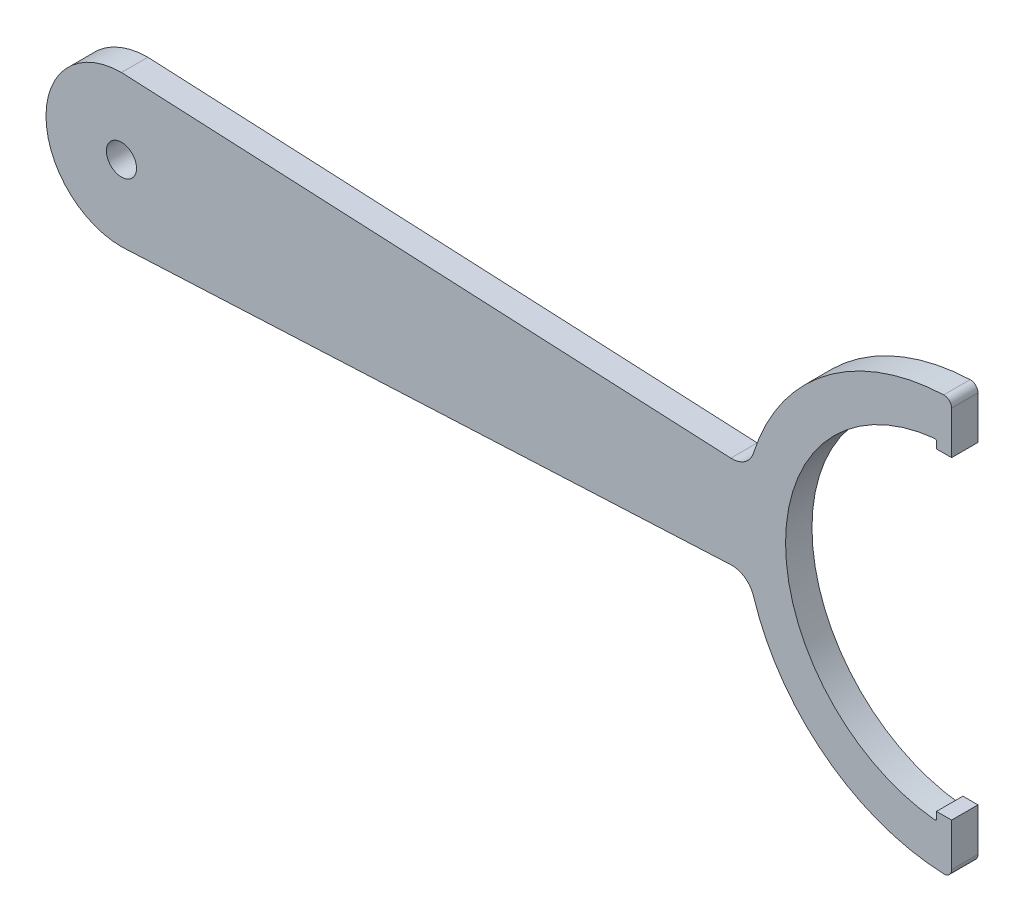
ISO-10303-21;
HEADER;
FILE_DESCRIPTION(('STEP AP214'),'2;1');
FILE_NAME('part.step','',(''),(''),'','','');
FILE_SCHEMA(('AUTOMOTIVE_DESIGN { 1 0 10303 214 1 1 1 1 }'));
ENDSEC;
DATA;
#1=APPLICATION_CONTEXT('core data for automotive mechanical design processes');
#2=APPLICATION_PROTOCOL_DEFINITION('international standard','automotive_design',2000,#1);
#3=PRODUCT_CONTEXT('',#1,'mechanical');
#4=PRODUCT('Part','Part','',(#3));
#5=PRODUCT_RELATED_PRODUCT_CATEGORY('part','',(#4));
#6=PRODUCT_DEFINITION_FORMATION('','',#4);
#7=PRODUCT_DEFINITION_CONTEXT('part definition',#1,'design');
#8=PRODUCT_DEFINITION('design','',#6,#7);
#9=PRODUCT_DEFINITION_SHAPE('','',#8);
#10=(LENGTH_UNIT() NAMED_UNIT(*) SI_UNIT(.MILLI.,.METRE.));
#11=(NAMED_UNIT(*) PLANE_ANGLE_UNIT() SI_UNIT($,.RADIAN.));
#12=(NAMED_UNIT(*) SI_UNIT($,.STERADIAN.) SOLID_ANGLE_UNIT());
#13=UNCERTAINTY_MEASURE_WITH_UNIT(LENGTH_MEASURE(1.E-05),#10,'distance_accuracy_value','');
#14=(GEOMETRIC_REPRESENTATION_CONTEXT(3) GLOBAL_UNCERTAINTY_ASSIGNED_CONTEXT((#13)) GLOBAL_UNIT_ASSIGNED_CONTEXT((#10,
#11,#12)) REPRESENTATION_CONTEXT('',''));
#15=CARTESIAN_POINT('',(0.,0.,0.));
#16=DIRECTION('',(0.,0.,1.));
#17=DIRECTION('',(1.,0.,0.));
#18=AXIS2_PLACEMENT_3D('',#15,#16,#17);
#19=CARTESIAN_POINT('',(0.,0.,3.5));
#20=DIRECTION('',(0.,0.,-1.));
#21=DIRECTION('',(-1.,0.,0.));
#22=AXIS2_PLACEMENT_3D('',#19,#20,#21);
#23=CYLINDRICAL_SURFACE('',#22,10.);
#24=CARTESIAN_POINT('',(0.,0.,0.));
#25=DIRECTION('',(0.,0.,1.));
#26=DIRECTION('',(1.,0.,0.));
#27=AXIS2_PLACEMENT_3D('',#24,#25,#26);
#28=CIRCLE('',#27,10.);
#29=CARTESIAN_POINT('',(0.,10.,0.));
#30=VERTEX_POINT('',#29);
#31=CARTESIAN_POINT('',(0.,-10.,0.));
#32=VERTEX_POINT('',#31);
#33=EDGE_CURVE('E181',#30,#32,#28,.T.);
#34=ORIENTED_EDGE('',*,*,#33,.T.);
#35=DIRECTION('',(0.,0.,-1.));
#36=VECTOR('',#35,1.);
#37=CARTESIAN_POINT('',(0.,-10.,3.5));
#38=LINE('',#37,#36);
#39=CARTESIAN_POINT('',(0.,-10.,3.5));
#40=VERTEX_POINT('',#39);
#41=EDGE_CURVE('E161',#40,#32,#38,.T.);
#42=ORIENTED_EDGE('',*,*,#41,.F.);
#43=CARTESIAN_POINT('',(0.,0.,3.5));
#44=DIRECTION('',(0.,0.,1.));
#45=DIRECTION('',(1.,0.,0.));
#46=AXIS2_PLACEMENT_3D('',#43,#44,#45);
#47=CIRCLE('',#46,10.);
#48=CARTESIAN_POINT('',(0.,10.,3.5));
#49=VERTEX_POINT('',#48);
#50=EDGE_CURVE('E168',#49,#40,#47,.T.);
#51=ORIENTED_EDGE('',*,*,#50,.F.);
#52=DIRECTION('',(0.,0.,-1.));
#53=VECTOR('',#52,1.);
#54=CARTESIAN_POINT('',(0.,10.,3.5));
#55=LINE('',#54,#53);
#56=EDGE_CURVE('E266',#49,#30,#55,.T.);
#57=ORIENTED_EDGE('',*,*,#56,.T.);
#58=EDGE_LOOP('',(#34,#42,#51,#57));
#59=FACE_BOUND('',#58,.T.);
#60=ADVANCED_FACE('F31',(#59),#23,.T.);
#61=CARTESIAN_POINT('',(0.,-10.,3.5));
#62=DIRECTION('',(-0.0480430459156585,0.998845266164458,0.));
#63=DIRECTION('',(-0.998845266164458,-0.0480430459156585,0.));
#64=AXIS2_PLACEMENT_3D('',#61,#62,#63);
#65=PLANE('',#64);
#66=DIRECTION('',(0.998845266164458,0.0480430459156585,0.));
#67=VECTOR('',#66,1.);
#68=CARTESIAN_POINT('',(0.,-10.,0.));
#69=LINE('',#68,#67);
#70=CARTESIAN_POINT('',(80.7489971112287,-6.11608733877766,0.));
#71=VERTEX_POINT('',#70);
#72=EDGE_CURVE('E293',#32,#71,#69,.T.);
#73=ORIENTED_EDGE('',*,*,#72,.T.);
#74=DIRECTION('',(0.,0.,1.));
#75=VECTOR('',#74,1.);
#76=CARTESIAN_POINT('',(80.7489971112286,-6.11608733877766,3.5));
#77=LINE('',#76,#75);
#78=CARTESIAN_POINT('',(80.7489971112287,-6.11608733877766,3.5));
#79=VERTEX_POINT('',#78);
#80=EDGE_CURVE('E164',#71,#79,#77,.T.);
#81=ORIENTED_EDGE('',*,*,#80,.T.);
#82=DIRECTION('',(0.998845266164458,0.0480430459156585,0.));
#83=VECTOR('',#82,1.);
#84=CARTESIAN_POINT('',(0.,-10.,3.5));
#85=LINE('',#84,#83);
#86=EDGE_CURVE('E156',#40,#79,#85,.T.);
#87=ORIENTED_EDGE('',*,*,#86,.F.);
#88=ORIENTED_EDGE('',*,*,#41,.T.);
#89=EDGE_LOOP('',(#73,#81,#87,#88));
#90=FACE_BOUND('',#89,.T.);
#91=ADVANCED_FACE('F159',(#90),#65,.F.);
#92=CARTESIAN_POINT('',(110.,0.,3.5));
#93=DIRECTION('',(0.,0.,-1.));
#94=DIRECTION('',(-1.,0.,0.));
#95=AXIS2_PLACEMENT_3D('',#92,#93,#94);
#96=CYLINDRICAL_SURFACE('',#95,27.5);
#97=CARTESIAN_POINT('',(110.,0.,0.));
#98=DIRECTION('',(0.,0.,1.));
#99=DIRECTION('',(1.,0.,0.));
#100=AXIS2_PLACEMENT_3D('',#97,#98,#99);
#101=CIRCLE('',#100,27.5);
#102=CARTESIAN_POINT('',(83.756097437601,-8.21629954999847,0.));
#103=VERTEX_POINT('',#102);
#104=CARTESIAN_POINT('',(108.962264150944,-27.4804131029281,0.));
#105=VERTEX_POINT('',#104);
#106=EDGE_CURVE('E290',#103,#105,#101,.T.);
#107=ORIENTED_EDGE('',*,*,#106,.T.);
#108=DIRECTION('',(0.,0.,-1.));
#109=VECTOR('',#108,1.);
#110=CARTESIAN_POINT('',(108.962264150944,-27.4804131029281,3.5));
#111=LINE('',#110,#109);
#112=CARTESIAN_POINT('',(108.962264150944,-27.4804131029281,3.5));
#113=VERTEX_POINT('',#112);
#114=EDGE_CURVE('E222',#105,#113,#111,.F.);
#115=ORIENTED_EDGE('',*,*,#114,.T.);
#116=CARTESIAN_POINT('',(110.,0.,3.5));
#117=DIRECTION('',(0.,0.,1.));
#118=DIRECTION('',(1.,0.,0.));
#119=AXIS2_PLACEMENT_3D('',#116,#117,#118);
#120=CIRCLE('',#119,27.5);
#121=CARTESIAN_POINT('',(83.756097437601,-8.21629954999847,3.5));
#122=VERTEX_POINT('',#121);
#123=EDGE_CURVE('E167',#122,#113,#120,.T.);
#124=ORIENTED_EDGE('',*,*,#123,.F.);
#125=DIRECTION('',(0.,0.,-1.));
#126=VECTOR('',#125,1.);
#127=CARTESIAN_POINT('',(83.756097437601,-8.21629954999847,3.5));
#128=LINE('',#127,#126);
#129=EDGE_CURVE('E200',#122,#103,#128,.T.);
#130=ORIENTED_EDGE('',*,*,#129,.T.);
#131=EDGE_LOOP('',(#107,#115,#124,#130));
#132=FACE_BOUND('',#131,.T.);
#133=ADVANCED_FACE('F344',(#132),#96,.T.);
#134=CARTESIAN_POINT('',(110.,-20.7944947177034,3.5));
#135=DIRECTION('',(-1.,0.,0.));
#136=DIRECTION('',(0.,-1.,0.));
#137=AXIS2_PLACEMENT_3D('',#134,#135,#136);
#138=PLANE('',#137);
#139=DIRECTION('',(0.,1.,0.));
#140=VECTOR('',#139,1.);
#141=CARTESIAN_POINT('',(110.,-20.7944947177034,3.5));
#142=LINE('',#141,#140);
#143=CARTESIAN_POINT('',(110.,-26.4811253537307,3.5));
#144=VERTEX_POINT('',#143);
#145=CARTESIAN_POINT('',(110.,-20.7944947177034,3.5));
#146=VERTEX_POINT('',#145);
#147=EDGE_CURVE('E311',#144,#146,#142,.T.);
#148=ORIENTED_EDGE('',*,*,#147,.F.);
#149=DIRECTION('',(0.,0.,-1.));
#150=VECTOR('',#149,1.);
#151=CARTESIAN_POINT('',(110.,-26.4811253537307,3.5));
#152=LINE('',#151,#150);
#153=CARTESIAN_POINT('',(110.,-26.4811253537307,0.));
#154=VERTEX_POINT('',#153);
#155=EDGE_CURVE('E217',#144,#154,#152,.T.);
#156=ORIENTED_EDGE('',*,*,#155,.T.);
#157=DIRECTION('',(0.,1.,0.));
#158=VECTOR('',#157,1.);
#159=CARTESIAN_POINT('',(110.,-20.7944947177034,0.));
#160=LINE('',#159,#158);
#161=CARTESIAN_POINT('',(110.,-20.7944947177034,0.));
#162=VERTEX_POINT('',#161);
#163=EDGE_CURVE('E286',#154,#162,#160,.T.);
#164=ORIENTED_EDGE('',*,*,#163,.T.);
#165=DIRECTION('',(0.,0.,-1.));
#166=VECTOR('',#165,1.);
#167=CARTESIAN_POINT('',(110.,-20.7944947177034,3.5));
#168=LINE('',#167,#166);
#169=EDGE_CURVE('E183',#146,#162,#168,.T.);
#170=ORIENTED_EDGE('',*,*,#169,.F.);
#171=EDGE_LOOP('',(#148,#156,#164,#170));
#172=FACE_BOUND('',#171,.T.);
#173=ADVANCED_FACE('F398',(#172),#138,.F.);
#174=CARTESIAN_POINT('',(110.,-20.7944947177034,3.5));
#175=DIRECTION('',(0.,-1.,0.));
#176=DIRECTION('',(0.,0.,-1.));
#177=AXIS2_PLACEMENT_3D('',#174,#175,#176);
#178=PLANE('',#177);
#179=DIRECTION('',(-1.,0.,0.));
#180=VECTOR('',#179,1.);
#181=CARTESIAN_POINT('',(110.,-20.7944947177034,0.));
#182=LINE('',#181,#180);
#183=CARTESIAN_POINT('',(108.,-20.7944947177034,0.));
#184=VERTEX_POINT('',#183);
#185=EDGE_CURVE('E285',#162,#184,#182,.T.);
#186=ORIENTED_EDGE('',*,*,#185,.T.);
#187=DIRECTION('',(0.,0.,-1.));
#188=VECTOR('',#187,1.);
#189=CARTESIAN_POINT('',(108.,-20.7944947177034,3.5));
#190=LINE('',#189,#188);
#191=CARTESIAN_POINT('',(108.,-20.7944947177034,3.5));
#192=VERTEX_POINT('',#191);
#193=EDGE_CURVE('E189',#192,#184,#190,.T.);
#194=ORIENTED_EDGE('',*,*,#193,.F.);
#195=DIRECTION('',(-1.,0.,0.));
#196=VECTOR('',#195,1.);
#197=CARTESIAN_POINT('',(110.,-20.7944947177034,3.5));
#198=LINE('',#197,#196);
#199=EDGE_CURVE('E309',#146,#192,#198,.T.);
#200=ORIENTED_EDGE('',*,*,#199,.F.);
#201=ORIENTED_EDGE('',*,*,#169,.T.);
#202=EDGE_LOOP('',(#186,#194,#200,#201));
#203=FACE_BOUND('',#202,.T.);
#204=ADVANCED_FACE('F399',(#203),#178,.F.);
#205=CARTESIAN_POINT('',(108.,-20.7944947177034,3.5));
#206=DIRECTION('',(1.,0.,0.));
#207=DIRECTION('',(0.,1.,0.));
#208=AXIS2_PLACEMENT_3D('',#205,#206,#207);
#209=PLANE('',#208);
#210=DIRECTION('',(0.,-1.,0.));
#211=VECTOR('',#210,1.);
#212=CARTESIAN_POINT('',(108.,-20.7944947177034,0.));
#213=LINE('',#212,#211);
#214=CARTESIAN_POINT('',(108.,-21.6887067387615,0.));
#215=VERTEX_POINT('',#214);
#216=EDGE_CURVE('E257',#184,#215,#213,.T.);
#217=ORIENTED_EDGE('',*,*,#216,.T.);
#218=DIRECTION('',(0.,0.,1.));
#219=VECTOR('',#218,1.);
#220=CARTESIAN_POINT('',(108.,-21.6887067387615,3.5));
#221=LINE('',#220,#219);
#222=CARTESIAN_POINT('',(108.,-21.6887067387615,3.5));
#223=VERTEX_POINT('',#222);
#224=EDGE_CURVE('E229',#215,#223,#221,.T.);
#225=ORIENTED_EDGE('',*,*,#224,.T.);
#226=DIRECTION('',(0.,-1.,0.));
#227=VECTOR('',#226,1.);
#228=CARTESIAN_POINT('',(108.,-20.7944947177034,3.5));
#229=LINE('',#228,#227);
#230=EDGE_CURVE('E281',#192,#223,#229,.T.);
#231=ORIENTED_EDGE('',*,*,#230,.F.);
#232=ORIENTED_EDGE('',*,*,#193,.T.);
#233=EDGE_LOOP('',(#217,#225,#231,#232));
#234=FACE_BOUND('',#233,.T.);
#235=ADVANCED_FACE('F278',(#234),#209,.F.);
#236=CARTESIAN_POINT('',(110.,0.,3.5));
#237=DIRECTION('',(0.,0.,-1.));
#238=DIRECTION('',(-1.,0.,0.));
#239=AXIS2_PLACEMENT_3D('',#236,#237,#238);
#240=CYLINDRICAL_SURFACE('',#239,22.);
#241=CARTESIAN_POINT('',(110.,0.,0.));
#242=DIRECTION('',(0.,0.,-1.));
#243=DIRECTION('',(1.,0.,0.));
#244=AXIS2_PLACEMENT_3D('',#241,#242,#243);
#245=CIRCLE('',#244,22.);
#246=CARTESIAN_POINT('',(107.779816513761,-21.8876856996676,0.));
#247=VERTEX_POINT('',#246);
#248=CARTESIAN_POINT('',(107.779816513761,21.8876856996676,0.));
#249=VERTEX_POINT('',#248);
#250=EDGE_CURVE('E253',#247,#249,#245,.T.);
#251=ORIENTED_EDGE('',*,*,#250,.T.);
#252=DIRECTION('',(0.,0.,-1.));
#253=VECTOR('',#252,1.);
#254=CARTESIAN_POINT('',(107.779816513761,21.8876856996676,3.5));
#255=LINE('',#254,#253);
#256=CARTESIAN_POINT('',(107.779816513761,21.8876856996676,3.5));
#257=VERTEX_POINT('',#256);
#258=EDGE_CURVE('E52',#249,#257,#255,.F.);
#259=ORIENTED_EDGE('',*,*,#258,.T.);
#260=CARTESIAN_POINT('',(110.,0.,3.5));
#261=DIRECTION('',(0.,0.,-1.));
#262=DIRECTION('',(1.,0.,0.));
#263=AXIS2_PLACEMENT_3D('',#260,#261,#262);
#264=CIRCLE('',#263,22.);
#265=CARTESIAN_POINT('',(107.779816513761,-21.8876856996676,3.5));
#266=VERTEX_POINT('',#265);
#267=EDGE_CURVE('E306',#266,#257,#264,.T.);
#268=ORIENTED_EDGE('',*,*,#267,.F.);
#269=DIRECTION('',(0.,0.,-1.));
#270=VECTOR('',#269,1.);
#271=CARTESIAN_POINT('',(107.779816513761,-21.8876856996676,3.5));
#272=LINE('',#271,#270);
#273=EDGE_CURVE('E226',#266,#247,#272,.T.);
#274=ORIENTED_EDGE('',*,*,#273,.T.);
#275=EDGE_LOOP('',(#251,#259,#268,#274));
#276=FACE_BOUND('',#275,.T.);
#277=ADVANCED_FACE('F370',(#276),#240,.F.);
#278=CARTESIAN_POINT('',(108.,20.7944947177034,3.5));
#279=DIRECTION('',(1.,0.,0.));
#280=DIRECTION('',(0.,0.,-1.));
#281=AXIS2_PLACEMENT_3D('',#278,#279,#280);
#282=PLANE('',#281);
#283=DIRECTION('',(0.,-1.,0.));
#284=VECTOR('',#283,1.);
#285=CARTESIAN_POINT('',(108.,20.7944947177034,3.5));
#286=LINE('',#285,#284);
#287=CARTESIAN_POINT('',(108.,21.6887067387615,3.5));
#288=VERTEX_POINT('',#287);
#289=CARTESIAN_POINT('',(108.,20.7944947177034,3.5));
#290=VERTEX_POINT('',#289);
#291=EDGE_CURVE('E245',#288,#290,#286,.T.);
#292=ORIENTED_EDGE('',*,*,#291,.F.);
#293=DIRECTION('',(0.,0.,1.));
#294=VECTOR('',#293,1.);
#295=CARTESIAN_POINT('',(108.,21.6887067387615,0.));
#296=LINE('',#295,#294);
#297=CARTESIAN_POINT('',(108.,21.6887067387615,0.));
#298=VERTEX_POINT('',#297);
#299=EDGE_CURVE('E235',#288,#298,#296,.F.);
#300=ORIENTED_EDGE('',*,*,#299,.T.);
#301=DIRECTION('',(0.,-1.,0.));
#302=VECTOR('',#301,1.);
#303=CARTESIAN_POINT('',(108.,20.7944947177034,0.));
#304=LINE('',#303,#302);
#305=CARTESIAN_POINT('',(108.,20.7944947177034,0.));
#306=VERTEX_POINT('',#305);
#307=EDGE_CURVE('E243',#298,#306,#304,.T.);
#308=ORIENTED_EDGE('',*,*,#307,.T.);
#309=DIRECTION('',(0.,0.,-1.));
#310=VECTOR('',#309,1.);
#311=CARTESIAN_POINT('',(108.,20.7944947177034,3.5));
#312=LINE('',#311,#310);
#313=EDGE_CURVE('E271',#290,#306,#312,.T.);
#314=ORIENTED_EDGE('',*,*,#313,.F.);
#315=EDGE_LOOP('',(#292,#300,#308,#314));
#316=FACE_BOUND('',#315,.T.);
#317=ADVANCED_FACE('F241',(#316),#282,.F.);
#318=CARTESIAN_POINT('',(110.,20.7944947177034,3.5));
#319=DIRECTION('',(0.,1.,0.));
#320=DIRECTION('',(0.,0.,1.));
#321=AXIS2_PLACEMENT_3D('',#318,#319,#320);
#322=PLANE('',#321);
#323=DIRECTION('',(1.,0.,0.));
#324=VECTOR('',#323,1.);
#325=CARTESIAN_POINT('',(110.,20.7944947177034,0.));
#326=LINE('',#325,#324);
#327=CARTESIAN_POINT('',(110.,20.7944947177034,0.));
#328=VERTEX_POINT('',#327);
#329=EDGE_CURVE('E252',#306,#328,#326,.T.);
#330=ORIENTED_EDGE('',*,*,#329,.T.);
#331=DIRECTION('',(0.,0.,-1.));
#332=VECTOR('',#331,1.);
#333=CARTESIAN_POINT('',(110.,20.7944947177034,3.5));
#334=LINE('',#333,#332);
#335=CARTESIAN_POINT('',(110.,20.7944947177034,3.5));
#336=VERTEX_POINT('',#335);
#337=EDGE_CURVE('E268',#336,#328,#334,.T.);
#338=ORIENTED_EDGE('',*,*,#337,.F.);
#339=DIRECTION('',(1.,0.,0.));
#340=VECTOR('',#339,1.);
#341=CARTESIAN_POINT('',(110.,20.7944947177034,3.5));
#342=LINE('',#341,#340);
#343=EDGE_CURVE('E303',#290,#336,#342,.T.);
#344=ORIENTED_EDGE('',*,*,#343,.F.);
#345=ORIENTED_EDGE('',*,*,#313,.T.);
#346=EDGE_LOOP('',(#330,#338,#344,#345));
#347=FACE_BOUND('',#346,.T.);
#348=ADVANCED_FACE('F374',(#347),#322,.F.);
#349=CARTESIAN_POINT('',(110.,20.7944947177034,3.5));
#350=DIRECTION('',(-1.,0.,0.));
#351=DIRECTION('',(0.,-1.,0.));
#352=AXIS2_PLACEMENT_3D('',#349,#350,#351);
#353=PLANE('',#352);
#354=DIRECTION('',(0.,1.,0.));
#355=VECTOR('',#354,1.);
#356=CARTESIAN_POINT('',(110.,20.7944947177034,0.));
#357=LINE('',#356,#355);
#358=CARTESIAN_POINT('',(110.,26.4811253537307,0.));
#359=VERTEX_POINT('',#358);
#360=EDGE_CURVE('E255',#328,#359,#357,.T.);
#361=ORIENTED_EDGE('',*,*,#360,.T.);
#362=DIRECTION('',(0.,0.,-1.));
#363=VECTOR('',#362,1.);
#364=CARTESIAN_POINT('',(110.,26.4811253537307,3.5));
#365=LINE('',#364,#363);
#366=CARTESIAN_POINT('',(110.,26.4811253537307,3.5));
#367=VERTEX_POINT('',#366);
#368=EDGE_CURVE('E213',#359,#367,#365,.F.);
#369=ORIENTED_EDGE('',*,*,#368,.T.);
#370=DIRECTION('',(0.,1.,0.));
#371=VECTOR('',#370,1.);
#372=CARTESIAN_POINT('',(110.,20.7944947177034,3.5));
#373=LINE('',#372,#371);
#374=EDGE_CURVE('E300',#336,#367,#373,.T.);
#375=ORIENTED_EDGE('',*,*,#374,.F.);
#376=ORIENTED_EDGE('',*,*,#337,.T.);
#377=EDGE_LOOP('',(#361,#369,#375,#376));
#378=FACE_BOUND('',#377,.T.);
#379=ADVANCED_FACE('F377',(#378),#353,.F.);
#380=CARTESIAN_POINT('',(110.,0.,3.5));
#381=DIRECTION('',(0.,0.,-1.));
#382=DIRECTION('',(-1.,0.,0.));
#383=AXIS2_PLACEMENT_3D('',#380,#381,#382);
#384=CYLINDRICAL_SURFACE('',#383,27.5);
#385=CARTESIAN_POINT('',(110.,0.,3.5));
#386=DIRECTION('',(0.,0.,1.));
#387=DIRECTION('',(1.,0.,0.));
#388=AXIS2_PLACEMENT_3D('',#385,#386,#387);
#389=CIRCLE('',#388,27.5);
#390=CARTESIAN_POINT('',(108.962264150943,27.4804131029281,3.5));
#391=VERTEX_POINT('',#390);
#392=CARTESIAN_POINT('',(83.756097437601,8.21629954999873,3.5));
#393=VERTEX_POINT('',#392);
#394=EDGE_CURVE('E298',#391,#393,#389,.T.);
#395=ORIENTED_EDGE('',*,*,#394,.F.);
#396=DIRECTION('',(0.,0.,-1.));
#397=VECTOR('',#396,1.);
#398=CARTESIAN_POINT('',(108.962264150943,27.4804131029281,3.5));
#399=LINE('',#398,#397);
#400=CARTESIAN_POINT('',(108.962264150943,27.4804131029281,0.));
#401=VERTEX_POINT('',#400);
#402=EDGE_CURVE('E208',#391,#401,#399,.T.);
#403=ORIENTED_EDGE('',*,*,#402,.T.);
#404=CARTESIAN_POINT('',(110.,0.,0.));
#405=DIRECTION('',(0.,0.,1.));
#406=DIRECTION('',(1.,0.,0.));
#407=AXIS2_PLACEMENT_3D('',#404,#405,#406);
#408=CIRCLE('',#407,27.5);
#409=CARTESIAN_POINT('',(83.756097437601,8.21629954999873,0.));
#410=VERTEX_POINT('',#409);
#411=EDGE_CURVE('E263',#401,#410,#408,.T.);
#412=ORIENTED_EDGE('',*,*,#411,.T.);
#413=DIRECTION('',(0.,0.,-1.));
#414=VECTOR('',#413,1.);
#415=CARTESIAN_POINT('',(83.756097437601,8.21629954999874,3.5));
#416=LINE('',#415,#414);
#417=EDGE_CURVE('E186',#410,#393,#416,.F.);
#418=ORIENTED_EDGE('',*,*,#417,.T.);
#419=EDGE_LOOP('',(#395,#403,#412,#418));
#420=FACE_BOUND('',#419,.T.);
#421=ADVANCED_FACE('F336',(#420),#384,.T.);
#422=CARTESIAN_POINT('',(0.,10.,3.5));
#423=DIRECTION('',(-0.0480430459156549,-0.998845266164458,0.));
#424=DIRECTION('',(0.998845266164458,-0.0480430459156549,0.));
#425=AXIS2_PLACEMENT_3D('',#422,#423,#424);
#426=PLANE('',#425);
#427=DIRECTION('',(-0.998845266164458,0.0480430459156549,0.));
#428=VECTOR('',#427,1.);
#429=CARTESIAN_POINT('',(0.,10.,3.5));
#430=LINE('',#429,#428);
#431=CARTESIAN_POINT('',(80.7489971112287,6.11608733877795,3.5));
#432=VERTEX_POINT('',#431);
#433=EDGE_CURVE('E174',#432,#49,#430,.T.);
#434=ORIENTED_EDGE('',*,*,#433,.F.);
#435=DIRECTION('',(0.,0.,1.));
#436=VECTOR('',#435,1.);
#437=CARTESIAN_POINT('',(80.7489971112287,6.11608733877795,0.));
#438=LINE('',#437,#436);
#439=CARTESIAN_POINT('',(80.7489971112287,6.11608733877795,0.));
#440=VERTEX_POINT('',#439);
#441=EDGE_CURVE('E182',#432,#440,#438,.F.);
#442=ORIENTED_EDGE('',*,*,#441,.T.);
#443=DIRECTION('',(-0.998845266164458,0.0480430459156549,0.));
#444=VECTOR('',#443,1.);
#445=CARTESIAN_POINT('',(0.,10.,0.));
#446=LINE('',#445,#444);
#447=EDGE_CURVE('E178',#440,#30,#446,.T.);
#448=ORIENTED_EDGE('',*,*,#447,.T.);
#449=ORIENTED_EDGE('',*,*,#56,.F.);
#450=EDGE_LOOP('',(#434,#442,#448,#449));
#451=FACE_BOUND('',#450,.T.);
#452=ADVANCED_FACE('F328',(#451),#426,.F.);
#453=CARTESIAN_POINT('',(0.,0.,3.5));
#454=DIRECTION('',(0.,0.,1.));
#455=DIRECTION('',(1.,0.,0.));
#456=AXIS2_PLACEMENT_3D('',#453,#454,#455);
#457=PLANE('',#456);
#458=CARTESIAN_POINT('',(0.,0.,3.5));
#459=DIRECTION('',(0.,0.,1.));
#460=DIRECTION('',(1.,0.,0.));
#461=AXIS2_PLACEMENT_3D('',#458,#459,#460);
#462=CIRCLE('',#461,2.);
#463=CARTESIAN_POINT('',(2.,0.,3.5));
#464=VERTEX_POINT('',#463);
#465=EDGE_CURVE('E314',#464,#464,#462,.T.);
#466=ORIENTED_EDGE('',*,*,#465,.F.);
#467=EDGE_LOOP('',(#466));
#468=FACE_BOUND('',#467,.T.);
#469=ORIENTED_EDGE('',*,*,#123,.T.);
#470=CARTESIAN_POINT('',(109.,-26.4811253537307,3.5));
#471=DIRECTION('',(0.,0.,1.));
#472=DIRECTION('',(1.,0.,0.));
#473=AXIS2_PLACEMENT_3D('',#470,#471,#472);
#474=CIRCLE('',#473,1.);
#475=EDGE_CURVE('E224',#113,#144,#474,.T.);
#476=ORIENTED_EDGE('',*,*,#475,.T.);
#477=ORIENTED_EDGE('',*,*,#147,.T.);
#478=ORIENTED_EDGE('',*,*,#199,.T.);
#479=ORIENTED_EDGE('',*,*,#230,.T.);
#480=CARTESIAN_POINT('',(107.8,-21.6887067387615,3.5));
#481=DIRECTION('',(0.,0.,1.));
#482=DIRECTION('',(1.,0.,0.));
#483=AXIS2_PLACEMENT_3D('',#480,#481,#482);
#484=CIRCLE('',#483,0.2);
#485=EDGE_CURVE('E233',#223,#266,#484,.F.);
#486=ORIENTED_EDGE('',*,*,#485,.T.);
#487=ORIENTED_EDGE('',*,*,#267,.T.);
#488=CARTESIAN_POINT('',(107.8,21.6887067387615,3.5));
#489=DIRECTION('',(0.,0.,1.));
#490=DIRECTION('',(1.,0.,0.));
#491=AXIS2_PLACEMENT_3D('',#488,#489,#490);
#492=CIRCLE('',#491,0.2);
#493=EDGE_CURVE('E11',#257,#288,#492,.F.);
#494=ORIENTED_EDGE('',*,*,#493,.T.);
#495=ORIENTED_EDGE('',*,*,#291,.T.);
#496=ORIENTED_EDGE('',*,*,#343,.T.);
#497=ORIENTED_EDGE('',*,*,#374,.T.);
#498=CARTESIAN_POINT('',(109.,26.4811253537307,3.5));
#499=DIRECTION('',(0.,0.,1.));
#500=DIRECTION('',(1.,0.,0.));
#501=AXIS2_PLACEMENT_3D('',#498,#499,#500);
#502=CIRCLE('',#501,1.);
#503=EDGE_CURVE('E215',#367,#391,#502,.T.);
#504=ORIENTED_EDGE('',*,*,#503,.T.);
#505=ORIENTED_EDGE('',*,*,#394,.T.);
#506=CARTESIAN_POINT('',(80.8931262489757,9.11262313727133,3.5));
#507=DIRECTION('',(0.,0.,1.));
#508=DIRECTION('',(1.,0.,0.));
#509=AXIS2_PLACEMENT_3D('',#506,#507,#508);
#510=CIRCLE('',#509,3.);
#511=EDGE_CURVE('E198',#393,#432,#510,.F.);
#512=ORIENTED_EDGE('',*,*,#511,.T.);
#513=ORIENTED_EDGE('',*,*,#433,.T.);
#514=ORIENTED_EDGE('',*,*,#50,.T.);
#515=ORIENTED_EDGE('',*,*,#86,.T.);
#516=CARTESIAN_POINT('',(80.8931262489756,-9.11262313727104,3.5));
#517=DIRECTION('',(0.,0.,1.));
#518=DIRECTION('',(1.,0.,0.));
#519=AXIS2_PLACEMENT_3D('',#516,#517,#518);
#520=CIRCLE('',#519,3.);
#521=EDGE_CURVE('E206',#79,#122,#520,.F.);
#522=ORIENTED_EDGE('',*,*,#521,.T.);
#523=EDGE_LOOP('',(#469,#476,#477,#478,#479,#486,#487,#494,#495,#496,#497,#504,#505,#512,#513,
#514,#515,#522));
#524=FACE_BOUND('',#523,.T.);
#525=ADVANCED_FACE('F172',(#468,#524),#457,.T.);
#526=CARTESIAN_POINT('',(0.,0.,0.));
#527=DIRECTION('',(0.,0.,1.));
#528=DIRECTION('',(1.,0.,0.));
#529=AXIS2_PLACEMENT_3D('',#526,#527,#528);
#530=PLANE('',#529);
#531=CARTESIAN_POINT('',(0.,0.,0.));
#532=DIRECTION('',(0.,0.,1.));
#533=DIRECTION('',(1.,0.,0.));
#534=AXIS2_PLACEMENT_3D('',#531,#532,#533);
#535=CIRCLE('',#534,2.);
#536=CARTESIAN_POINT('',(2.,0.,0.));
#537=VERTEX_POINT('',#536);
#538=EDGE_CURVE('E296',#537,#537,#535,.T.);
#539=ORIENTED_EDGE('',*,*,#538,.T.);
#540=EDGE_LOOP('',(#539));
#541=FACE_BOUND('',#540,.T.);
#542=ORIENTED_EDGE('',*,*,#163,.F.);
#543=CARTESIAN_POINT('',(109.,-26.4811253537307,0.));
#544=DIRECTION('',(0.,0.,1.));
#545=DIRECTION('',(1.,0.,0.));
#546=AXIS2_PLACEMENT_3D('',#543,#544,#545);
#547=CIRCLE('',#546,1.);
#548=EDGE_CURVE('E220',#154,#105,#547,.F.);
#549=ORIENTED_EDGE('',*,*,#548,.T.);
#550=ORIENTED_EDGE('',*,*,#106,.F.);
#551=CARTESIAN_POINT('',(80.8931262489756,-9.11262313727104,0.));
#552=DIRECTION('',(0.,0.,1.));
#553=DIRECTION('',(1.,0.,0.));
#554=AXIS2_PLACEMENT_3D('',#551,#552,#553);
#555=CIRCLE('',#554,3.);
#556=EDGE_CURVE('E204',#103,#71,#555,.T.);
#557=ORIENTED_EDGE('',*,*,#556,.T.);
#558=ORIENTED_EDGE('',*,*,#72,.F.);
#559=ORIENTED_EDGE('',*,*,#33,.F.);
#560=ORIENTED_EDGE('',*,*,#447,.F.);
#561=CARTESIAN_POINT('',(80.8931262489757,9.11262313727133,0.));
#562=DIRECTION('',(0.,0.,1.));
#563=DIRECTION('',(1.,0.,0.));
#564=AXIS2_PLACEMENT_3D('',#561,#562,#563);
#565=CIRCLE('',#564,3.);
#566=EDGE_CURVE('E195',#440,#410,#565,.T.);
#567=ORIENTED_EDGE('',*,*,#566,.T.);
#568=ORIENTED_EDGE('',*,*,#411,.F.);
#569=CARTESIAN_POINT('',(109.,26.4811253537307,0.));
#570=DIRECTION('',(0.,0.,1.));
#571=DIRECTION('',(1.,0.,0.));
#572=AXIS2_PLACEMENT_3D('',#569,#570,#571);
#573=CIRCLE('',#572,1.);
#574=EDGE_CURVE('E211',#401,#359,#573,.F.);
#575=ORIENTED_EDGE('',*,*,#574,.T.);
#576=ORIENTED_EDGE('',*,*,#360,.F.);
#577=ORIENTED_EDGE('',*,*,#329,.F.);
#578=ORIENTED_EDGE('',*,*,#307,.F.);
#579=CARTESIAN_POINT('',(107.8,21.6887067387615,0.));
#580=DIRECTION('',(0.,0.,1.));
#581=DIRECTION('',(1.,0.,0.));
#582=AXIS2_PLACEMENT_3D('',#579,#580,#581);
#583=CIRCLE('',#582,0.2);
#584=EDGE_CURVE('E39',#298,#249,#583,.T.);
#585=ORIENTED_EDGE('',*,*,#584,.T.);
#586=ORIENTED_EDGE('',*,*,#250,.F.);
#587=CARTESIAN_POINT('',(107.8,-21.6887067387615,0.));
#588=DIRECTION('',(0.,0.,1.));
#589=DIRECTION('',(1.,0.,0.));
#590=AXIS2_PLACEMENT_3D('',#587,#588,#589);
#591=CIRCLE('',#590,0.2);
#592=EDGE_CURVE('E231',#247,#215,#591,.T.);
#593=ORIENTED_EDGE('',*,*,#592,.T.);
#594=ORIENTED_EDGE('',*,*,#216,.F.);
#595=ORIENTED_EDGE('',*,*,#185,.F.);
#596=EDGE_LOOP('',(#542,#549,#550,#557,#558,#559,#560,#567,#568,#575,#576,#577,#578,#585,#586,
#593,#594,#595));
#597=FACE_BOUND('',#596,.T.);
#598=ADVANCED_FACE('F250',(#541,#597),#530,.F.);
#599=CARTESIAN_POINT('',(80.8931262489757,9.11262313727133,3.5));
#600=DIRECTION('',(0.,0.,-1.));
#601=DIRECTION('',(-1.,0.,0.));
#602=AXIS2_PLACEMENT_3D('',#599,#600,#601);
#603=CYLINDRICAL_SURFACE('',#602,3.);
#604=ORIENTED_EDGE('',*,*,#511,.F.);
#605=ORIENTED_EDGE('',*,*,#417,.F.);
#606=ORIENTED_EDGE('',*,*,#566,.F.);
#607=ORIENTED_EDGE('',*,*,#441,.F.);
#608=EDGE_LOOP('',(#604,#605,#606,#607));
#609=FACE_BOUND('',#608,.T.);
#610=ADVANCED_FACE('F334',(#609),#603,.F.);
#611=CARTESIAN_POINT('',(80.8931262489756,-9.11262313727104,3.5));
#612=DIRECTION('',(0.,0.,-1.));
#613=DIRECTION('',(-1.,0.,0.));
#614=AXIS2_PLACEMENT_3D('',#611,#612,#613);
#615=CYLINDRICAL_SURFACE('',#614,3.);
#616=ORIENTED_EDGE('',*,*,#521,.F.);
#617=ORIENTED_EDGE('',*,*,#80,.F.);
#618=ORIENTED_EDGE('',*,*,#556,.F.);
#619=ORIENTED_EDGE('',*,*,#129,.F.);
#620=EDGE_LOOP('',(#616,#617,#618,#619));
#621=FACE_BOUND('',#620,.T.);
#622=ADVANCED_FACE('F350',(#621),#615,.F.);
#623=CARTESIAN_POINT('',(109.,26.4811253537307,3.5));
#624=DIRECTION('',(0.,0.,-1.));
#625=DIRECTION('',(-1.,0.,0.));
#626=AXIS2_PLACEMENT_3D('',#623,#624,#625);
#627=CYLINDRICAL_SURFACE('',#626,1.);
#628=ORIENTED_EDGE('',*,*,#503,.F.);
#629=ORIENTED_EDGE('',*,*,#368,.F.);
#630=ORIENTED_EDGE('',*,*,#574,.F.);
#631=ORIENTED_EDGE('',*,*,#402,.F.);
#632=EDGE_LOOP('',(#628,#629,#630,#631));
#633=FACE_BOUND('',#632,.T.);
#634=ADVANCED_FACE('F354',(#633),#627,.T.);
#635=CARTESIAN_POINT('',(109.,-26.4811253537307,3.5));
#636=DIRECTION('',(0.,0.,-1.));
#637=DIRECTION('',(-1.,0.,0.));
#638=AXIS2_PLACEMENT_3D('',#635,#636,#637);
#639=CYLINDRICAL_SURFACE('',#638,1.);
#640=ORIENTED_EDGE('',*,*,#475,.F.);
#641=ORIENTED_EDGE('',*,*,#114,.F.);
#642=ORIENTED_EDGE('',*,*,#548,.F.);
#643=ORIENTED_EDGE('',*,*,#155,.F.);
#644=EDGE_LOOP('',(#640,#641,#642,#643));
#645=FACE_BOUND('',#644,.T.);
#646=ADVANCED_FACE('F358',(#645),#639,.T.);
#647=CARTESIAN_POINT('',(107.8,-21.6887067387615,3.5));
#648=DIRECTION('',(0.,0.,-1.));
#649=DIRECTION('',(-1.,0.,0.));
#650=AXIS2_PLACEMENT_3D('',#647,#648,#649);
#651=CYLINDRICAL_SURFACE('',#650,0.2);
#652=ORIENTED_EDGE('',*,*,#485,.F.);
#653=ORIENTED_EDGE('',*,*,#224,.F.);
#654=ORIENTED_EDGE('',*,*,#592,.F.);
#655=ORIENTED_EDGE('',*,*,#273,.F.);
#656=EDGE_LOOP('',(#652,#653,#654,#655));
#657=FACE_BOUND('',#656,.T.);
#658=ADVANCED_FACE('F361',(#657),#651,.F.);
#659=CARTESIAN_POINT('',(107.8,21.6887067387615,3.5));
#660=DIRECTION('',(0.,0.,-1.));
#661=DIRECTION('',(-1.,0.,0.));
#662=AXIS2_PLACEMENT_3D('',#659,#660,#661);
#663=CYLINDRICAL_SURFACE('',#662,0.2);
#664=ORIENTED_EDGE('',*,*,#493,.F.);
#665=ORIENTED_EDGE('',*,*,#258,.F.);
#666=ORIENTED_EDGE('',*,*,#584,.F.);
#667=ORIENTED_EDGE('',*,*,#299,.F.);
#668=EDGE_LOOP('',(#664,#665,#666,#667));
#669=FACE_BOUND('',#668,.T.);
#670=ADVANCED_FACE('F33',(#669),#663,.F.);
#671=CARTESIAN_POINT('',(0.,0.,0.));
#672=DIRECTION('',(0.,0.,1.));
#673=DIRECTION('',(1.,0.,0.));
#674=AXIS2_PLACEMENT_3D('',#671,#672,#673);
#675=CYLINDRICAL_SURFACE('',#674,2.);
#676=ORIENTED_EDGE('',*,*,#538,.F.);
#677=EDGE_LOOP('',(#676));
#678=FACE_BOUND('',#677,.T.);
#679=ORIENTED_EDGE('',*,*,#465,.T.);
#680=EDGE_LOOP('',(#679));
#681=FACE_BOUND('',#680,.T.);
#682=ADVANCED_FACE('F321',(#678,#681),#675,.F.);
#683=CLOSED_SHELL('',(#60,#91,#133,#173,#204,#235,#277,#317,#348,#379,#421,#452,#525,#598,#610,
#622,#634,#646,#658,#670,#682));
#684=MANIFOLD_SOLID_BREP('B2',#683);
#685=ADVANCED_BREP_SHAPE_REPRESENTATION('',(#18,#684),#14);
#686=SHAPE_DEFINITION_REPRESENTATION(#9,#685);
ENDSEC;
END-ISO-10303-21;
